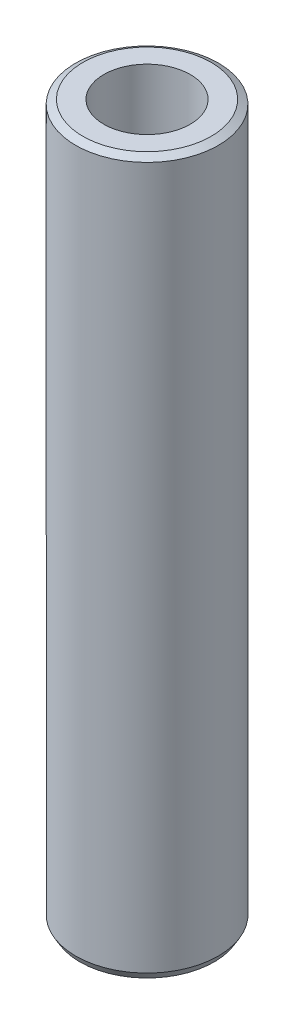
ISO-10303-21;
HEADER;
FILE_DESCRIPTION(('STEP AP214'),'2;1');
FILE_NAME('part.step','',(''),(''),'','','');
FILE_SCHEMA(('AUTOMOTIVE_DESIGN { 1 0 10303 214 1 1 1 1 }'));
ENDSEC;
DATA;
#1=APPLICATION_CONTEXT('core data for automotive mechanical design processes');
#2=APPLICATION_PROTOCOL_DEFINITION('international standard','automotive_design',2000,#1);
#3=PRODUCT_CONTEXT('',#1,'mechanical');
#4=PRODUCT('Part','Part','',(#3));
#5=PRODUCT_RELATED_PRODUCT_CATEGORY('part','',(#4));
#6=PRODUCT_DEFINITION_FORMATION('','',#4);
#7=PRODUCT_DEFINITION_CONTEXT('part definition',#1,'design');
#8=PRODUCT_DEFINITION('design','',#6,#7);
#9=PRODUCT_DEFINITION_SHAPE('','',#8);
#10=(LENGTH_UNIT() NAMED_UNIT(*) SI_UNIT(.MILLI.,.METRE.));
#11=(NAMED_UNIT(*) PLANE_ANGLE_UNIT() SI_UNIT($,.RADIAN.));
#12=(NAMED_UNIT(*) SI_UNIT($,.STERADIAN.) SOLID_ANGLE_UNIT());
#13=UNCERTAINTY_MEASURE_WITH_UNIT(LENGTH_MEASURE(1.E-05),#10,'distance_accuracy_value','');
#14=(GEOMETRIC_REPRESENTATION_CONTEXT(3) GLOBAL_UNCERTAINTY_ASSIGNED_CONTEXT((#13)) GLOBAL_UNIT_ASSIGNED_CONTEXT((#10,
#11,#12)) REPRESENTATION_CONTEXT('',''));
#15=CARTESIAN_POINT('',(0.,0.,0.));
#16=DIRECTION('',(0.,0.,1.));
#17=DIRECTION('',(1.,0.,0.));
#18=AXIS2_PLACEMENT_3D('',#15,#16,#17);
#19=CARTESIAN_POINT('',(0.,600.,0.));
#20=DIRECTION('',(0.,-1.,0.));
#21=DIRECTION('',(0.,0.,-1.));
#22=AXIS2_PLACEMENT_3D('',#19,#20,#21);
#23=CYLINDRICAL_SURFACE('',#22,60.);
#24=CARTESIAN_POINT('',(0.,596.483595758543,0.));
#25=DIRECTION('',(0.,1.,0.));
#26=DIRECTION('',(0.,0.,1.));
#27=AXIS2_PLACEMENT_3D('',#24,#25,#26);
#28=CIRCLE('',#27,60.);
#29=CARTESIAN_POINT('',(0.,596.483595758543,-60.0000000000001));
#30=VERTEX_POINT('',#29);
#31=EDGE_CURVE('E50',#30,#30,#28,.F.);
#32=ORIENTED_EDGE('',*,*,#31,.T.);
#33=EDGE_LOOP('',(#32));
#34=FACE_BOUND('',#33,.T.);
#35=CARTESIAN_POINT('',(0.,6.09059080615493,0.));
#36=DIRECTION('',(0.,1.,0.));
#37=DIRECTION('',(0.,0.,1.));
#38=AXIS2_PLACEMENT_3D('',#35,#36,#37);
#39=CIRCLE('',#38,60.);
#40=CARTESIAN_POINT('',(0.,6.09059080615493,60.));
#41=VERTEX_POINT('',#40);
#42=EDGE_CURVE('E51',#41,#41,#39,.T.);
#43=ORIENTED_EDGE('',*,*,#42,.T.);
#44=EDGE_LOOP('',(#43));
#45=FACE_BOUND('',#44,.T.);
#46=ADVANCED_FACE('F39',(#34,#45),#23,.T.);
#47=CARTESIAN_POINT('',(0.,600.,0.));
#48=DIRECTION('',(0.,1.,0.));
#49=DIRECTION('',(0.,0.,1.));
#50=AXIS2_PLACEMENT_3D('',#47,#48,#49);
#51=PLANE('',#50);
#52=CARTESIAN_POINT('',(0.,600.,0.));
#53=DIRECTION('',(0.,1.,0.));
#54=DIRECTION('',(0.,0.,1.));
#55=AXIS2_PLACEMENT_3D('',#52,#53,#54);
#56=CIRCLE('',#55,53.9094091938453);
#57=CARTESIAN_POINT('',(0.,600.,-53.9094091938454));
#58=VERTEX_POINT('',#57);
#59=EDGE_CURVE('E54',#58,#58,#56,.T.);
#60=ORIENTED_EDGE('',*,*,#59,.T.);
#61=EDGE_LOOP('',(#60));
#62=FACE_BOUND('',#61,.T.);
#63=CARTESIAN_POINT('',(0.,600.,0.));
#64=DIRECTION('',(0.,1.,0.));
#65=DIRECTION('',(0.,0.,1.));
#66=AXIS2_PLACEMENT_3D('',#63,#64,#65);
#67=CIRCLE('',#66,36.3198025318733);
#68=CARTESIAN_POINT('',(0.,600.,36.3198025318733));
#69=VERTEX_POINT('',#68);
#70=EDGE_CURVE('E58',#69,#69,#67,.T.);
#71=ORIENTED_EDGE('',*,*,#70,.F.);
#72=EDGE_LOOP('',(#71));
#73=FACE_BOUND('',#72,.T.);
#74=ADVANCED_FACE('F69',(#62,#73),#51,.T.);
#75=CARTESIAN_POINT('',(0.,0.,0.));
#76=DIRECTION('',(0.,1.,0.));
#77=DIRECTION('',(0.,0.,1.));
#78=AXIS2_PLACEMENT_3D('',#75,#76,#77);
#79=PLANE('',#78);
#80=CARTESIAN_POINT('',(0.,0.,0.));
#81=DIRECTION('',(0.,1.,0.));
#82=DIRECTION('',(0.,0.,1.));
#83=AXIS2_PLACEMENT_3D('',#80,#81,#82);
#84=CIRCLE('',#83,56.4835957585425);
#85=CARTESIAN_POINT('',(0.,0.,56.4835957585425));
#86=VERTEX_POINT('',#85);
#87=EDGE_CURVE('E10',#86,#86,#84,.F.);
#88=ORIENTED_EDGE('',*,*,#87,.T.);
#89=EDGE_LOOP('',(#88));
#90=FACE_BOUND('',#89,.T.);
#91=CARTESIAN_POINT('',(0.,0.,0.));
#92=DIRECTION('',(0.,1.,0.));
#93=DIRECTION('',(0.,0.,1.));
#94=AXIS2_PLACEMENT_3D('',#91,#92,#93);
#95=CIRCLE('',#94,36.3198025318733);
#96=CARTESIAN_POINT('',(0.,0.,36.3198025318733));
#97=VERTEX_POINT('',#96);
#98=EDGE_CURVE('E63',#97,#97,#95,.T.);
#99=ORIENTED_EDGE('',*,*,#98,.T.);
#100=EDGE_LOOP('',(#99));
#101=FACE_BOUND('',#100,.T.);
#102=ADVANCED_FACE('F75',(#90,#101),#79,.F.);
#103=CARTESIAN_POINT('',(0.,600.,0.));
#104=DIRECTION('',(0.,-1.,0.));
#105=DIRECTION('',(0.,0.,-1.));
#106=AXIS2_PLACEMENT_3D('',#103,#104,#105);
#107=CYLINDRICAL_SURFACE('',#106,36.3198025318733);
#108=ORIENTED_EDGE('',*,*,#70,.T.);
#109=EDGE_LOOP('',(#108));
#110=FACE_BOUND('',#109,.T.);
#111=ORIENTED_EDGE('',*,*,#98,.F.);
#112=EDGE_LOOP('',(#111));
#113=FACE_BOUND('',#112,.T.);
#114=ADVANCED_FACE('F70',(#110,#113),#107,.F.);
#115=CARTESIAN_POINT('',(0.,600.,0.));
#116=DIRECTION('',(0.,-1.,0.));
#117=DIRECTION('',(0.,0.,-1.));
#118=AXIS2_PLACEMENT_3D('',#115,#116,#117);
#119=CONICAL_SURFACE('',#118,53.9094091938453,1.04719755119659);
#120=CARTESIAN_POINT('',(0.,596.483595758543,-60.0000000000001));
#121=CARTESIAN_POINT('',(0.,596.520224969391,-59.9365563457693));
#122=CARTESIAN_POINT('',(0.,596.55685418024,-59.8731126915385));
#123=CARTESIAN_POINT('',(0.,596.630112601937,-59.746225383077));
#124=CARTESIAN_POINT('',(0.,596.666741812785,-59.6827817288462));
#125=CARTESIAN_POINT('',(0.,596.740000234482,-59.5558944203846));
#126=CARTESIAN_POINT('',(0.,596.776629445331,-59.4924507661539));
#127=CARTESIAN_POINT('',(0.,596.849887867028,-59.3655634576923));
#128=CARTESIAN_POINT('',(0.,596.886517077876,-59.3021198034615));
#129=CARTESIAN_POINT('',(0.,596.959775499573,-59.175232495));
#130=CARTESIAN_POINT('',(0.,596.996404710422,-59.1117888407692));
#131=CARTESIAN_POINT('',(0.,597.069663132119,-58.9849015323077));
#132=CARTESIAN_POINT('',(0.,597.106292342967,-58.9214578780769));
#133=CARTESIAN_POINT('',(0.,597.179550764664,-58.7945705696153));
#134=CARTESIAN_POINT('',(0.,597.216179975513,-58.7311269153846));
#135=CARTESIAN_POINT('',(0.,597.28943839721,-58.604239606923));
#136=CARTESIAN_POINT('',(0.,597.326067608059,-58.5407959526922));
#137=CARTESIAN_POINT('',(0.,597.399326029755,-58.4139086442306));
#138=CARTESIAN_POINT('',(0.,597.435955240604,-58.3504649899999));
#139=CARTESIAN_POINT('',(0.,597.509213662301,-58.2235776815383));
#140=CARTESIAN_POINT('',(0.,597.545842873149,-58.1601340273076));
#141=CARTESIAN_POINT('',(0.,597.619101294846,-58.033246718846));
#142=CARTESIAN_POINT('',(0.,597.655730505695,-57.9698030646152));
#143=CARTESIAN_POINT('',(0.,597.728988927392,-57.8429157561537));
#144=CARTESIAN_POINT('',(0.,597.765618138241,-57.7794721019229));
#145=CARTESIAN_POINT('',(0.,597.838876559938,-57.6525847934613));
#146=CARTESIAN_POINT('',(0.,597.875505770786,-57.5891411392305));
#147=CARTESIAN_POINT('',(0.,597.948764192483,-57.462253830769));
#148=CARTESIAN_POINT('',(0.,597.985393403332,-57.3988101765382));
#149=CARTESIAN_POINT('',(0.,598.058651825029,-57.2719228680767));
#150=CARTESIAN_POINT('',(0.,598.095281035877,-57.2084792138459));
#151=CARTESIAN_POINT('',(0.,598.168539457574,-57.0815919053843));
#152=CARTESIAN_POINT('',(0.,598.205168668423,-57.0181482511536));
#153=CARTESIAN_POINT('',(0.,598.27842709012,-56.891260942692));
#154=CARTESIAN_POINT('',(0.,598.315056300968,-56.8278172884612));
#155=CARTESIAN_POINT('',(0.,598.388314722665,-56.7009299799997));
#156=CARTESIAN_POINT('',(0.,598.424943933514,-56.6374863257689));
#157=CARTESIAN_POINT('',(0.,598.498202355211,-56.5105990173073));
#158=CARTESIAN_POINT('',(0.,598.534831566059,-56.4471553630766));
#159=CARTESIAN_POINT('',(0.,598.608089987756,-56.320268054615));
#160=CARTESIAN_POINT('',(0.,598.644719198605,-56.2568244003842));
#161=CARTESIAN_POINT('',(0.,598.717977620302,-56.1299370919227));
#162=CARTESIAN_POINT('',(0.,598.75460683115,-56.0664934376919));
#163=CARTESIAN_POINT('',(0.,598.827865252847,-55.9396061292303));
#164=CARTESIAN_POINT('',(0.,598.864494463696,-55.8761624749995));
#165=CARTESIAN_POINT('',(0.,598.937752885393,-55.749275166538));
#166=CARTESIAN_POINT('',(0.,598.974382096242,-55.6858315123072));
#167=CARTESIAN_POINT('',(0.,599.047640517939,-55.5589442038457));
#168=CARTESIAN_POINT('',(0.,599.084269728787,-55.4955005496149));
#169=CARTESIAN_POINT('',(0.,599.157528150484,-55.3686132411533));
#170=CARTESIAN_POINT('',(0.,599.194157361332,-55.3051695869225));
#171=CARTESIAN_POINT('',(0.,599.26741578303,-55.178282278461));
#172=CARTESIAN_POINT('',(0.,599.304044993878,-55.1148386242302));
#173=CARTESIAN_POINT('',(0.,599.377303415575,-54.9879513157687));
#174=CARTESIAN_POINT('',(0.,599.413932626424,-54.9245076615379));
#175=CARTESIAN_POINT('',(0.,599.487191048121,-54.7976203530763));
#176=CARTESIAN_POINT('',(0.,599.523820258969,-54.7341766988456));
#177=CARTESIAN_POINT('',(0.,599.597078680666,-54.607289390384));
#178=CARTESIAN_POINT('',(0.,599.633707891515,-54.5438457361532));
#179=CARTESIAN_POINT('',(0.,599.706966313212,-54.4169584276917));
#180=CARTESIAN_POINT('',(0.,599.74359552406,-54.3535147734609));
#181=CARTESIAN_POINT('',(0.,599.816853945757,-54.2266274649993));
#182=CARTESIAN_POINT('',(0.,599.853483156606,-54.1631838107686));
#183=CARTESIAN_POINT('',(0.,599.926741578303,-54.036296502307));
#184=CARTESIAN_POINT('',(0.,599.963370789151,-53.9728528480762));
#185=CARTESIAN_POINT('',(0.,600.,-53.9094091938454));
#186=B_SPLINE_CURVE_WITH_KNOTS('',3,(#120,#121,#122,#123,#124,#125,#126,#127,#128,#129,#130,
#131,#132,#133,#134,#135,#136,#137,#138,#139,#140,#141,#142,#143,#144,#145,#146,#147,#148,#149,
#150,#151,#152,#153,#154,#155,#156,#157,#158,#159,#160,#161,#162,#163,#164,#165,#166,#167,#168,
#169,#170,#171,#172,#173,#174,#175,#176,#177,#178,#179,#180,#181,#182,#183,#184,#185),
.UNSPECIFIED.,.F.,.F.,(4,2,2,2,2,2,2,2,2,2,2,2,2,2,2,2,2,2,2,2,2,2,2,2,2,2,2,2,2,2,2,2,4),(0.,
0.219775265091053,0.439550530182111,0.659325795273219,0.879101060364272,1.09887632545539,
1.31865159054644,1.53842685563755,1.7582021207286,1.97797738581965,2.19775265091077,
2.41752791600182,2.63730318109293,2.85707844618398,3.07685371127509,3.29662897636615,
3.51640424145725,3.73617950654831,3.95595477163936,4.17573003673047,4.39550530182153,
4.61528056691263,4.83505583200369,5.0548310970948,5.27460636218585,5.49438162727691,
5.71415689236802,5.93393215745907,6.15370742255018,6.37348268764123,6.59325795273235,
6.8130332178234,7.03280848291451),.UNSPECIFIED.);
#187=EDGE_CURVE('BSEAM81',#30,#58,#186,.T.);
#188=ORIENTED_EDGE('',*,*,#31,.F.);
#189=ORIENTED_EDGE('',*,*,#59,.F.);
#190=ORIENTED_EDGE('',*,*,#187,.T.);
#191=ORIENTED_EDGE('',*,*,#187,.F.);
#192=EDGE_LOOP('',(#188,#190,#189,#191));
#193=FACE_BOUND('',#192,.T.);
#194=ADVANCED_FACE('F81',(#193),#119,.T.);
#195=CARTESIAN_POINT('',(0.,6.09059080615493,0.));
#196=DIRECTION('',(0.,1.,0.));
#197=DIRECTION('',(0.,0.,1.));
#198=AXIS2_PLACEMENT_3D('',#195,#196,#197);
#199=CONICAL_SURFACE('',#198,60.,0.523598775598309);
#200=ORIENTED_EDGE('',*,*,#87,.F.);
#201=EDGE_LOOP('',(#200));
#202=FACE_BOUND('',#201,.T.);
#203=ORIENTED_EDGE('',*,*,#42,.F.);
#204=EDGE_LOOP('',(#203));
#205=FACE_BOUND('',#204,.T.);
#206=ADVANCED_FACE('F45',(#202,#205),#199,.T.);
#207=CLOSED_SHELL('',(#46,#74,#102,#114,#194,#206));
#208=MANIFOLD_SOLID_BREP('B2',#207);
#209=ADVANCED_BREP_SHAPE_REPRESENTATION('',(#18,#208),#14);
#210=SHAPE_DEFINITION_REPRESENTATION(#9,#209);
ENDSEC;
END-ISO-10303-21;
